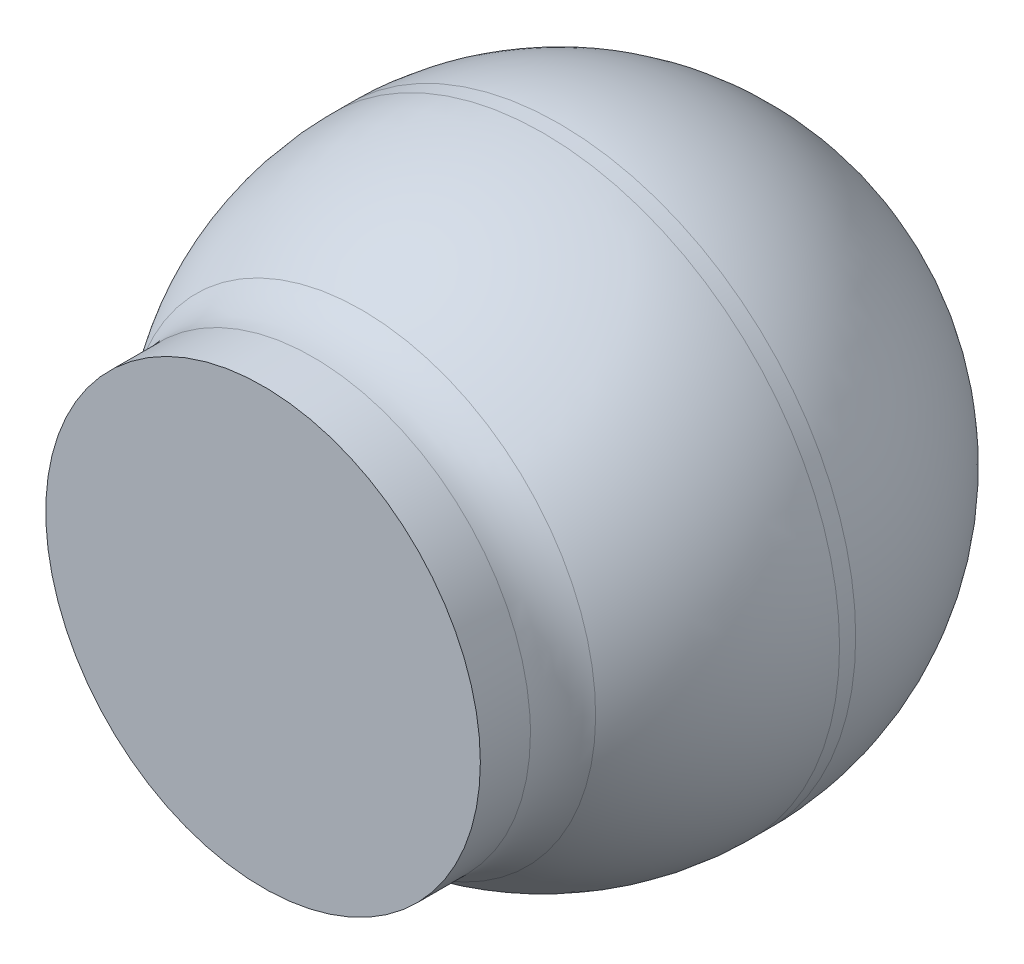
ISO-10303-21;
HEADER;
FILE_DESCRIPTION(('STEP AP214'),'2;1');
FILE_NAME('part.step','',(''),(''),'','','');
FILE_SCHEMA(('AUTOMOTIVE_DESIGN { 1 0 10303 214 1 1 1 1 }'));
ENDSEC;
DATA;
#1=APPLICATION_CONTEXT('core data for automotive mechanical design processes');
#2=APPLICATION_PROTOCOL_DEFINITION('international standard','automotive_design',2000,#1);
#3=PRODUCT_CONTEXT('',#1,'mechanical');
#4=PRODUCT('Part','Part','',(#3));
#5=PRODUCT_RELATED_PRODUCT_CATEGORY('part','',(#4));
#6=PRODUCT_DEFINITION_FORMATION('','',#4);
#7=PRODUCT_DEFINITION_CONTEXT('part definition',#1,'design');
#8=PRODUCT_DEFINITION('design','',#6,#7);
#9=PRODUCT_DEFINITION_SHAPE('','',#8);
#10=(LENGTH_UNIT() NAMED_UNIT(*) SI_UNIT(.MILLI.,.METRE.));
#11=(NAMED_UNIT(*) PLANE_ANGLE_UNIT() SI_UNIT($,.RADIAN.));
#12=(NAMED_UNIT(*) SI_UNIT($,.STERADIAN.) SOLID_ANGLE_UNIT());
#13=UNCERTAINTY_MEASURE_WITH_UNIT(LENGTH_MEASURE(1.E-05),#10,'distance_accuracy_value','');
#14=(GEOMETRIC_REPRESENTATION_CONTEXT(3) GLOBAL_UNCERTAINTY_ASSIGNED_CONTEXT((#13)) GLOBAL_UNIT_ASSIGNED_CONTEXT((#10,
#11,#12)) REPRESENTATION_CONTEXT('',''));
#15=CARTESIAN_POINT('',(0.,0.,0.));
#16=DIRECTION('',(0.,0.,1.));
#17=DIRECTION('',(1.,0.,0.));
#18=AXIS2_PLACEMENT_3D('',#15,#16,#17);
#19=CARTESIAN_POINT('',(0.707080077731,-6.591349291452,10.006534503384));
#20=DIRECTION('',(0.,0.,-1.));
#21=DIRECTION('',(-1.,0.,0.));
#22=AXIS2_PLACEMENT_3D('',#19,#20,#21);
#23=PLANE('',#22);
#24=CARTESIAN_POINT('',(0.707080077731,-6.591349291452,10.006534503384));
#25=DIRECTION('',(0.,0.,1.));
#26=DIRECTION('',(1.,0.,0.));
#27=AXIS2_PLACEMENT_3D('',#24,#25,#26);
#28=CIRCLE('',#27,0.275);
#29=CARTESIAN_POINT('',(0.982080077731,-6.591349291452,10.006534503384));
#30=VERTEX_POINT('',#29);
#31=EDGE_CURVE('E20',#30,#30,#28,.F.);
#32=ORIENTED_EDGE('',*,*,#31,.F.);
#33=EDGE_LOOP('',(#32));
#34=FACE_BOUND('',#33,.T.);
#35=ADVANCED_FACE('F17',(#34),#23,.F.);
#36=CARTESIAN_POINT('',(0.707080077731,-6.591349291452,9.906534503384));
#37=DIRECTION('',(0.,0.,1.));
#38=DIRECTION('',(1.,0.,0.));
#39=AXIS2_PLACEMENT_3D('',#36,#37,#38);
#40=CYLINDRICAL_SURFACE('',#39,0.275);
#41=CARTESIAN_POINT('',(0.707080077731,-6.591349291452,9.943180457728));
#42=DIRECTION('',(0.,0.,-1.));
#43=DIRECTION('',(0.996700902337583,0.0811622527992438,0.));
#44=AXIS2_PLACEMENT_3D('',#41,#42,#43);
#45=CIRCLE('',#44,0.275);
#46=CARTESIAN_POINT('',(0.981172825873835,-6.56902967193221,9.943180457728));
#47=VERTEX_POINT('',#46);
#48=EDGE_CURVE('E65',#47,#47,#45,.F.);
#49=ORIENTED_EDGE('',*,*,#48,.T.);
#50=EDGE_LOOP('',(#49));
#51=FACE_BOUND('',#50,.T.);
#52=ORIENTED_EDGE('',*,*,#31,.T.);
#53=EDGE_LOOP('',(#52));
#54=FACE_BOUND('',#53,.T.);
#55=ADVANCED_FACE('F62',(#51,#54),#40,.T.);
#56=CARTESIAN_POINT('',(0.707080077731,-6.591349291452,9.943180457728));
#57=DIRECTION('',(0.,0.,-1.));
#58=DIRECTION('',(0.996700902337583,0.0811622527992449,0.));
#59=AXIS2_PLACEMENT_3D('',#56,#57,#58);
#60=TOROIDAL_SURFACE('',#59,0.375,0.1);
#61=ORIENTED_EDGE('',*,*,#48,.F.);
#62=EDGE_LOOP('',(#61));
#63=FACE_BOUND('',#62,.T.);
#64=CARTESIAN_POINT('',(0.707080077731001,-6.591349291452,9.881744931236));
#65=DIRECTION('',(0.,0.,-1.));
#66=DIRECTION('',(-0.996700902337598,-0.0811622527990592,0.));
#67=AXIS2_PLACEMENT_3D('',#64,#65,#66);
#68=CIRCLE('',#67,0.296097046412665);
#69=CARTESIAN_POINT('',(0.411959884392,-6.615381194786,9.881744931236));
#70=VERTEX_POINT('',#69);
#71=EDGE_CURVE('E39',#70,#70,#68,.T.);
#72=ORIENTED_EDGE('',*,*,#71,.F.);
#73=EDGE_LOOP('',(#72));
#74=FACE_BOUND('',#73,.T.);
#75=ADVANCED_FACE('F57',(#63,#74),#60,.F.);
#76=CARTESIAN_POINT('',(0.333317239355,-6.621785136252,9.651976062157));
#77=CARTESIAN_POINT('',(0.333317239355,-6.621785136252,9.701461392103));
#78=CARTESIAN_POINT('',(0.341473782652,-6.621120941579,9.750947004335));
#79=CARTESIAN_POINT('',(0.357792914651,-6.619792059952,9.798626332798));
#80=CARTESIAN_POINT('',(0.381658609162,-6.617848654938,9.842699544317));
#81=CARTESIAN_POINT('',(0.411959884392,-6.615381194786,9.881744931236));
#82=(BOUNDED_CURVE() B_SPLINE_CURVE(5,(#76,#77,#78,#79,#80,#81),.UNSPECIFIED.,.F.,
.F.) B_SPLINE_CURVE_WITH_KNOTS((6,6),(0.,0.661568582165),
.UNSPECIFIED.) CURVE() GEOMETRIC_REPRESENTATION_ITEM() RATIONAL_B_SPLINE_CURVE((1.,1.,1.,1.,1.,1.)) REPRESENTATION_ITEM(''));
#83=CARTESIAN_POINT('',(0.707080077731,-6.591349291452,9.651976062157));
#84=DIRECTION('',(0.,0.,-1.));
#85=AXIS1_PLACEMENT('',#83,#84);
#86=SURFACE_OF_REVOLUTION('',#82,#85);
#87=CARTESIAN_POINT('',(0.707080077731001,-6.591349291452,9.651976062157));
#88=DIRECTION('',(0.,0.,1.));
#89=DIRECTION('',(1.,0.,0.));
#90=AXIS2_PLACEMENT_3D('',#87,#88,#89);
#91=CIRCLE('',#90,0.375);
#92=CARTESIAN_POINT('',(1.082080077731,-6.591349291452,9.651976062157));
#93=VERTEX_POINT('',#92);
#94=EDGE_CURVE('E36',#93,#93,#91,.F.);
#95=ORIENTED_EDGE('',*,*,#94,.F.);
#96=EDGE_LOOP('',(#95));
#97=FACE_BOUND('',#96,.T.);
#98=ORIENTED_EDGE('',*,*,#71,.T.);
#99=EDGE_LOOP('',(#98));
#100=FACE_BOUND('',#99,.T.);
#101=ADVANCED_FACE('F53',(#97,#100),#86,.F.);
#102=CARTESIAN_POINT('',(0.707080077731,-6.591349291452,9.256534503384));
#103=DIRECTION('',(0.,0.,1.));
#104=DIRECTION('',(1.,0.,0.));
#105=AXIS2_PLACEMENT_3D('',#102,#103,#104);
#106=CYLINDRICAL_SURFACE('',#105,0.375);
#107=CARTESIAN_POINT('',(0.707080077731,-6.591349291452,9.631534503384));
#108=DIRECTION('',(0.,0.,-1.));
#109=DIRECTION('',(0.0811622527992362,-0.996700902337583,0.));
#110=AXIS2_PLACEMENT_3D('',#107,#108,#109);
#111=CIRCLE('',#110,0.375);
#112=CARTESIAN_POINT('',(0.737515922530713,-6.96511212982859,9.631534503384));
#113=VERTEX_POINT('',#112);
#114=CARTESIAN_POINT('',(0.676644232931287,-6.21758645307541,9.631534503384));
#115=VERTEX_POINT('',#114);
#116=EDGE_CURVE('E11',#113,#115,#111,.T.);
#117=ORIENTED_EDGE('',*,*,#116,.F.);
#118=CARTESIAN_POINT('',(0.707080077731,-6.591349291452,9.631534503384));
#119=DIRECTION('',(0.,0.,1.));
#120=DIRECTION('',(0.0811622527992359,-0.996700902337583,0.));
#121=AXIS2_PLACEMENT_3D('',#118,#119,#120);
#122=CIRCLE('',#121,0.375);
#123=EDGE_CURVE('E25',#115,#113,#122,.F.);
#124=ORIENTED_EDGE('',*,*,#123,.F.);
#125=EDGE_LOOP('',(#117,#124));
#126=FACE_BOUND('',#125,.T.);
#127=ORIENTED_EDGE('',*,*,#94,.T.);
#128=EDGE_LOOP('',(#127));
#129=FACE_BOUND('',#128,.T.);
#130=ADVANCED_FACE('F34',(#126,#129),#106,.T.);
#131=CARTESIAN_POINT('',(0.707080077731,-6.591349291452,9.631534503384));
#132=DIRECTION('',(0.0811622527992361,-0.996700902337583,0.));
#133=DIRECTION('',(-0.996700902337583,-0.0811622527992361,0.));
#134=AXIS2_PLACEMENT_3D('',#131,#132,#133);
#135=SPHERICAL_SURFACE('',#134,0.375);
#136=ORIENTED_EDGE('',*,*,#123,.T.);
#137=ORIENTED_EDGE('',*,*,#116,.T.);
#138=EDGE_LOOP('',(#136,#137));
#139=FACE_BOUND('',#138,.T.);
#140=ADVANCED_FACE('F32',(#139),#135,.T.);
#141=CLOSED_SHELL('',(#35,#55,#75,#101,#130,#140));
#142=MANIFOLD_SOLID_BREP('B1',#141);
#143=ADVANCED_BREP_SHAPE_REPRESENTATION('',(#18,#142),#14);
#144=SHAPE_DEFINITION_REPRESENTATION(#9,#143);
ENDSEC;
END-ISO-10303-21;
